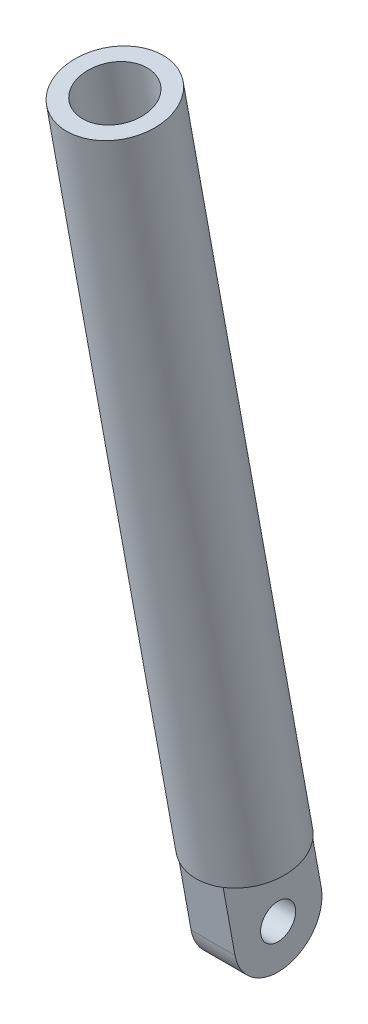
ISO-10303-21;
HEADER;
FILE_DESCRIPTION(('STEP AP214'),'2;1');
FILE_NAME('part.step','',(''),(''),'','','');
FILE_SCHEMA(('AUTOMOTIVE_DESIGN { 1 0 10303 214 1 1 1 1 }'));
ENDSEC;
DATA;
#1=APPLICATION_CONTEXT('core data for automotive mechanical design processes');
#2=APPLICATION_PROTOCOL_DEFINITION('international standard','automotive_design',2000,#1);
#3=PRODUCT_CONTEXT('',#1,'mechanical');
#4=PRODUCT('Part','Part','',(#3));
#5=PRODUCT_RELATED_PRODUCT_CATEGORY('part','',(#4));
#6=PRODUCT_DEFINITION_FORMATION('','',#4);
#7=PRODUCT_DEFINITION_CONTEXT('part definition',#1,'design');
#8=PRODUCT_DEFINITION('design','',#6,#7);
#9=PRODUCT_DEFINITION_SHAPE('','',#8);
#10=(LENGTH_UNIT() NAMED_UNIT(*) SI_UNIT(.MILLI.,.METRE.));
#11=(NAMED_UNIT(*) PLANE_ANGLE_UNIT() SI_UNIT($,.RADIAN.));
#12=(NAMED_UNIT(*) SI_UNIT($,.STERADIAN.) SOLID_ANGLE_UNIT());
#13=UNCERTAINTY_MEASURE_WITH_UNIT(LENGTH_MEASURE(1.E-05),#10,'distance_accuracy_value','');
#14=(GEOMETRIC_REPRESENTATION_CONTEXT(3) GLOBAL_UNCERTAINTY_ASSIGNED_CONTEXT((#13)) GLOBAL_UNIT_ASSIGNED_CONTEXT((#10,
#11,#12)) REPRESENTATION_CONTEXT('',''));
#15=CARTESIAN_POINT('',(0.,0.,0.));
#16=DIRECTION('',(0.,0.,1.));
#17=DIRECTION('',(1.,0.,0.));
#18=AXIS2_PLACEMENT_3D('',#15,#16,#17);
#19=CARTESIAN_POINT('',(1550.00000000001,-478.633122855309,65.2704072888008));
#20=DIRECTION('',(0.,-0.983852787309741,-0.178979587950284));
#21=DIRECTION('',(-1.,0.,0.));
#22=AXIS2_PLACEMENT_3D('',#19,#20,#21);
#23=PLANE('',#22);
#24=CARTESIAN_POINT('',(1550.00000000001,-478.633122855309,65.2704072888008));
#25=DIRECTION('',(0.,0.983852787309741,0.178979587950284));
#26=DIRECTION('',(1.,0.,0.));
#27=AXIS2_PLACEMENT_3D('',#24,#25,#26);
#28=CIRCLE('',#27,74.9999999999999);
#29=CARTESIAN_POINT('',(1625.00000000001,-478.633122855309,65.2704072888009));
#30=VERTEX_POINT('',#29);
#31=EDGE_CURVE('E19',#30,#30,#28,.T.);
#32=ORIENTED_EDGE('',*,*,#31,.T.);
#33=EDGE_LOOP('',(#32));
#34=FACE_BOUND('',#33,.T.);
#35=ADVANCED_FACE('F16',(#34),#23,.F.);
#36=CARTESIAN_POINT('',(1499.99999999996,-700.000000000001,24.9999999999866));
#37=DIRECTION('',(-1.,0.,0.));
#38=DIRECTION('',(0.,0.983852787309741,0.178979587950284));
#39=AXIS2_PLACEMENT_3D('',#36,#37,#38);
#40=CYLINDRICAL_SURFACE('',#39,40.);
#41=CARTESIAN_POINT('',(1499.99999999996,-700.000000000001,24.9999999999866));
#42=DIRECTION('',(-1.,0.,0.));
#43=DIRECTION('',(0.,0.983852787309741,0.178979587950284));
#44=AXIS2_PLACEMENT_3D('',#41,#42,#43);
#45=CIRCLE('',#44,40.);
#46=CARTESIAN_POINT('',(1499.99999999996,-660.645888507612,32.159183517998));
#47=VERTEX_POINT('',#46);
#48=EDGE_CURVE('E71',#47,#47,#45,.F.);
#49=ORIENTED_EDGE('',*,*,#48,.F.);
#50=EDGE_LOOP('',(#49));
#51=FACE_BOUND('',#50,.T.);
#52=CARTESIAN_POINT('',(1599.99999999996,-700.000000000001,24.9999999999866));
#53=DIRECTION('',(-1.,0.,0.));
#54=DIRECTION('',(0.,0.983852787309741,0.178979587950284));
#55=AXIS2_PLACEMENT_3D('',#52,#53,#54);
#56=CIRCLE('',#55,40.);
#57=CARTESIAN_POINT('',(1599.99999999996,-660.645888507612,32.159183517998));
#58=VERTEX_POINT('',#57);
#59=EDGE_CURVE('E65',#58,#58,#56,.T.);
#60=ORIENTED_EDGE('',*,*,#59,.F.);
#61=EDGE_LOOP('',(#60));
#62=FACE_BOUND('',#61,.T.);
#63=ADVANCED_FACE('F231',(#51,#62),#40,.F.);
#64=CARTESIAN_POINT('',(1599.99999999996,-700.000000000001,24.9999999999866));
#65=DIRECTION('',(-1.,0.,0.));
#66=DIRECTION('',(0.,0.983852787309741,0.178979587950284));
#67=AXIS2_PLACEMENT_3D('',#64,#65,#66);
#68=CYLINDRICAL_SURFACE('',#67,100.000000000001);
#69=CARTESIAN_POINT('',(1499.99999999996,-700.000000000001,24.9999999999866));
#70=DIRECTION('',(-1.,0.,0.));
#71=DIRECTION('',(0.,0.983852787309741,0.178979587950284));
#72=AXIS2_PLACEMENT_3D('',#69,#70,#71);
#73=CIRCLE('',#72,100.000000000001);
#74=CARTESIAN_POINT('',(1499.99999999996,-682.102041204972,-73.3852787309881));
#75=VERTEX_POINT('',#74);
#76=CARTESIAN_POINT('',(1499.99999999996,-717.897958795038,123.38527873096));
#77=VERTEX_POINT('',#76);
#78=EDGE_CURVE('E70',#75,#77,#73,.T.);
#79=ORIENTED_EDGE('',*,*,#78,.F.);
#80=DIRECTION('',(1.,0.,-2.3999686994746E-13));
#81=VECTOR('',#80,1.);
#82=CARTESIAN_POINT('',(1499.99999999996,-682.102041204972,-73.3852787309879));
#83=LINE('',#82,#81);
#84=CARTESIAN_POINT('',(1600.00000000001,-682.102041204968,-73.3852787310121));
#85=VERTEX_POINT('',#84);
#86=EDGE_CURVE('E67',#75,#85,#83,.T.);
#87=ORIENTED_EDGE('',*,*,#86,.T.);
#88=CARTESIAN_POINT('',(1600.00000000001,-700.000000000001,24.9999999999866));
#89=DIRECTION('',(-1.,0.,0.));
#90=DIRECTION('',(0.,0.983852787309741,0.178979587950284));
#91=AXIS2_PLACEMENT_3D('',#88,#89,#90);
#92=CIRCLE('',#91,100.000000000001);
#93=CARTESIAN_POINT('',(1599.99999999998,-717.897958795042,123.385278730984));
#94=VERTEX_POINT('',#93);
#95=EDGE_CURVE('E54',#94,#85,#92,.F.);
#96=ORIENTED_EDGE('',*,*,#95,.F.);
#97=DIRECTION('',(-1.,0.,-2.4061337766998E-13));
#98=VECTOR('',#97,1.);
#99=CARTESIAN_POINT('',(1600.00000000001,-717.897958795049,123.385278730983));
#100=LINE('',#99,#98);
#101=EDGE_CURVE('E83',#94,#77,#100,.T.);
#102=ORIENTED_EDGE('',*,*,#101,.T.);
#103=EDGE_LOOP('',(#79,#87,#96,#102));
#104=FACE_BOUND('',#103,.T.);
#105=ADVANCED_FACE('F68',(#104),#68,.T.);
#106=CARTESIAN_POINT('',(1600.00000000001,-570.320040698588,150.232216923525));
#107=DIRECTION('',(2.44550698842452E-13,0.178979587950284,-0.983852787309741));
#108=DIRECTION('',(-1.,0.,-2.4061337766998E-13));
#109=AXIS2_PLACEMENT_3D('',#106,#107,#108);
#110=PLANE('',#109);
#111=DIRECTION('',(0.,-0.983852787309741,-0.178979587950284));
#112=VECTOR('',#111,1.);
#113=CARTESIAN_POINT('',(1599.99999999996,-717.897958795033,123.385278730985));
#114=LINE('',#113,#112);
#115=CARTESIAN_POINT('',(1599.99999999998,-570.320040698581,150.232216923527));
#116=VERTEX_POINT('',#115);
#117=EDGE_CURVE('E64',#116,#94,#114,.T.);
#118=ORIENTED_EDGE('',*,*,#117,.F.);
#119=DIRECTION('',(1.,0.,0.));
#120=VECTOR('',#119,1.);
#121=CARTESIAN_POINT('',(1550.00000000001,-570.320040698573,150.232216923528));
#122=LINE('',#121,#120);
#123=CARTESIAN_POINT('',(1499.99999999998,-570.320040698571,150.232216923516));
#124=VERTEX_POINT('',#123);
#125=EDGE_CURVE('E101',#116,#124,#122,.F.);
#126=ORIENTED_EDGE('',*,*,#125,.T.);
#127=DIRECTION('',(0.,0.983852787309741,0.178979587950284));
#128=VECTOR('',#127,1.);
#129=CARTESIAN_POINT('',(1499.99999999996,-717.89795879503,123.385278730961));
#130=LINE('',#129,#128);
#131=EDGE_CURVE('E80',#77,#124,#130,.T.);
#132=ORIENTED_EDGE('',*,*,#131,.F.);
#133=ORIENTED_EDGE('',*,*,#101,.F.);
#134=EDGE_LOOP('',(#118,#126,#132,#133));
#135=FACE_BOUND('',#134,.T.);
#136=ADVANCED_FACE('F112',(#135),#110,.F.);
#137=CARTESIAN_POINT('',(1550.00000000001,1070.93501715753,347.163258310499));
#138=DIRECTION('',(0.,0.983852787309741,0.178979587950284));
#139=DIRECTION('',(1.,0.,0.));
#140=AXIS2_PLACEMENT_3D('',#137,#138,#139);
#141=CYLINDRICAL_SURFACE('',#140,74.9999999999999);
#142=CARTESIAN_POINT('',(1550.00000000001,1070.93501715753,347.163258310499));
#143=DIRECTION('',(0.,0.983852787309741,0.178979587950284));
#144=DIRECTION('',(1.,0.,0.));
#145=AXIS2_PLACEMENT_3D('',#142,#143,#144);
#146=CIRCLE('',#145,74.9999999999999);
#147=CARTESIAN_POINT('',(1625.00000000001,1070.93501715753,347.163258310499));
#148=VERTEX_POINT('',#147);
#149=EDGE_CURVE('E97',#148,#148,#146,.F.);
#150=ORIENTED_EDGE('',*,*,#149,.F.);
#151=EDGE_LOOP('',(#150));
#152=FACE_BOUND('',#151,.T.);
#153=ORIENTED_EDGE('',*,*,#31,.F.);
#154=EDGE_LOOP('',(#153));
#155=FACE_BOUND('',#154,.T.);
#156=ADVANCED_FACE('F110',(#152,#155),#141,.F.);
#157=CARTESIAN_POINT('',(1599.99999999996,-682.102041204972,-73.3852787309879));
#158=DIRECTION('',(1.,0.,0.));
#159=DIRECTION('',(0.,-0.983852787309741,-0.178979587950284));
#160=AXIS2_PLACEMENT_3D('',#157,#158,#159);
#161=PLANE('',#160);
#162=DIRECTION('',(0.,0.178979587950284,-0.983852787309741));
#163=VECTOR('',#162,1.);
#164=CARTESIAN_POINT('',(1600.00000000001,-552.42208190354,51.8469381925293));
#165=LINE('',#164,#163);
#166=CARTESIAN_POINT('',(1600.00000000003,-534.524123108517,-46.5383405384587));
#167=VERTEX_POINT('',#166);
#168=EDGE_CURVE('E100',#167,#116,#165,.F.);
#169=ORIENTED_EDGE('',*,*,#168,.T.);
#170=ORIENTED_EDGE('',*,*,#117,.T.);
#171=ORIENTED_EDGE('',*,*,#95,.T.);
#172=DIRECTION('',(0.,0.983852787309741,0.178979587950284));
#173=VECTOR('',#172,1.);
#174=CARTESIAN_POINT('',(1600.00000000001,-534.524123108523,-46.5383405384721));
#175=LINE('',#174,#173);
#176=EDGE_CURVE('E62',#85,#167,#175,.T.);
#177=ORIENTED_EDGE('',*,*,#176,.T.);
#178=EDGE_LOOP('',(#169,#170,#171,#177));
#179=FACE_BOUND('',#178,.T.);
#180=ORIENTED_EDGE('',*,*,#59,.T.);
#181=EDGE_LOOP('',(#180));
#182=FACE_BOUND('',#181,.T.);
#183=ADVANCED_FACE('F59',(#179,#182),#161,.T.);
#184=CARTESIAN_POINT('',(1499.99999999996,-534.524123108527,-46.5383405384481));
#185=DIRECTION('',(2.43947431992373E-13,-0.178979587950284,0.983852787309741));
#186=DIRECTION('',(1.,0.,-2.3999686994746E-13));
#187=AXIS2_PLACEMENT_3D('',#184,#185,#186);
#188=PLANE('',#187);
#189=DIRECTION('',(0.,0.983852787309741,0.178979587950284));
#190=VECTOR('',#189,1.);
#191=CARTESIAN_POINT('',(1499.99999999996,-682.102041204973,-73.3852787309881));
#192=LINE('',#191,#190);
#193=CARTESIAN_POINT('',(1499.99999999996,-534.524123108519,-46.5383405384467));
#194=VERTEX_POINT('',#193);
#195=EDGE_CURVE('E34',#194,#75,#192,.F.);
#196=ORIENTED_EDGE('',*,*,#195,.F.);
#197=DIRECTION('',(1.,0.,0.));
#198=VECTOR('',#197,1.);
#199=CARTESIAN_POINT('',(1550.00000000001,-534.524123108512,-46.5383405384454));
#200=LINE('',#199,#198);
#201=EDGE_CURVE('E75',#194,#167,#200,.T.);
#202=ORIENTED_EDGE('',*,*,#201,.T.);
#203=ORIENTED_EDGE('',*,*,#176,.F.);
#204=ORIENTED_EDGE('',*,*,#86,.F.);
#205=EDGE_LOOP('',(#196,#202,#203,#204));
#206=FACE_BOUND('',#205,.T.);
#207=ADVANCED_FACE('F73',(#206),#188,.F.);
#208=CARTESIAN_POINT('',(1499.99999999996,-700.000000000001,24.9999999999861));
#209=DIRECTION('',(-1.,0.,0.));
#210=DIRECTION('',(0.,0.983852787309741,0.178979587950284));
#211=AXIS2_PLACEMENT_3D('',#208,#209,#210);
#212=PLANE('',#211);
#213=DIRECTION('',(0.,0.178979587950284,-0.983852787309741));
#214=VECTOR('',#213,1.);
#215=CARTESIAN_POINT('',(1499.99999999996,-552.42208190354,51.8469381925293));
#216=LINE('',#215,#214);
#217=EDGE_CURVE('E96',#124,#194,#216,.T.);
#218=ORIENTED_EDGE('',*,*,#217,.T.);
#219=ORIENTED_EDGE('',*,*,#195,.T.);
#220=ORIENTED_EDGE('',*,*,#78,.T.);
#221=ORIENTED_EDGE('',*,*,#131,.T.);
#222=EDGE_LOOP('',(#218,#219,#220,#221));
#223=FACE_BOUND('',#222,.T.);
#224=ORIENTED_EDGE('',*,*,#48,.T.);
#225=EDGE_LOOP('',(#224));
#226=FACE_BOUND('',#225,.T.);
#227=ADVANCED_FACE('F151',(#223,#226),#212,.T.);
#228=CARTESIAN_POINT('',(1550.00000000001,-552.42208190354,51.8469381925293));
#229=DIRECTION('',(0.,0.983852787309741,0.178979587950284));
#230=DIRECTION('',(1.,0.,0.));
#231=AXIS2_PLACEMENT_3D('',#228,#229,#230);
#232=PLANE('',#231);
#233=ORIENTED_EDGE('',*,*,#125,.F.);
#234=CARTESIAN_POINT('',(1550.00000000001,-552.42208190354,51.8469381925293));
#235=DIRECTION('',(0.,-0.983852787309741,-0.178979587950284));
#236=DIRECTION('',(-1.,0.,0.));
#237=AXIS2_PLACEMENT_3D('',#234,#235,#236);
#238=CIRCLE('',#237,111.803398875012);
#239=EDGE_CURVE('E93',#124,#116,#238,.F.);
#240=ORIENTED_EDGE('',*,*,#239,.F.);
#241=EDGE_LOOP('',(#233,#240));
#242=FACE_BOUND('',#241,.T.);
#243=ADVANCED_FACE('F147',(#242),#232,.F.);
#244=CARTESIAN_POINT('',(1550.00000000001,1070.93501715753,347.163258310499));
#245=DIRECTION('',(0.,0.983852787309741,0.178979587950284));
#246=DIRECTION('',(1.,0.,0.));
#247=AXIS2_PLACEMENT_3D('',#244,#245,#246);
#248=PLANE('',#247);
#249=CARTESIAN_POINT('',(1550.00000000001,1070.93501715753,347.163258310499));
#250=DIRECTION('',(0.,-0.983852787309741,-0.178979587950284));
#251=DIRECTION('',(-1.,0.,0.));
#252=AXIS2_PLACEMENT_3D('',#249,#250,#251);
#253=CIRCLE('',#252,111.803398875012);
#254=CARTESIAN_POINT('',(1438.196601125,1070.93501715753,347.163258310499));
#255=VERTEX_POINT('',#254);
#256=EDGE_CURVE('E90',#255,#255,#253,.T.);
#257=ORIENTED_EDGE('',*,*,#256,.F.);
#258=EDGE_LOOP('',(#257));
#259=FACE_BOUND('',#258,.T.);
#260=ORIENTED_EDGE('',*,*,#149,.T.);
#261=EDGE_LOOP('',(#260));
#262=FACE_BOUND('',#261,.T.);
#263=ADVANCED_FACE('F143',(#259,#262),#248,.T.);
#264=CARTESIAN_POINT('',(1550.00000000001,-552.42208190354,51.8469381925293));
#265=DIRECTION('',(0.,0.983852787309741,0.178979587950284));
#266=DIRECTION('',(1.,0.,0.));
#267=AXIS2_PLACEMENT_3D('',#264,#265,#266);
#268=PLANE('',#267);
#269=CARTESIAN_POINT('',(1550.00000000001,-552.42208190354,51.8469381925293));
#270=DIRECTION('',(0.,-0.983852787309741,-0.178979587950284));
#271=DIRECTION('',(-1.,0.,0.));
#272=AXIS2_PLACEMENT_3D('',#269,#270,#271);
#273=CIRCLE('',#272,111.803398875012);
#274=EDGE_CURVE('E87',#116,#167,#273,.F.);
#275=ORIENTED_EDGE('',*,*,#274,.F.);
#276=ORIENTED_EDGE('',*,*,#168,.F.);
#277=EDGE_LOOP('',(#275,#276));
#278=FACE_BOUND('',#277,.T.);
#279=ADVANCED_FACE('F139',(#278),#268,.F.);
#280=CARTESIAN_POINT('',(1550.00000000001,-552.42208190354,51.8469381925293));
#281=DIRECTION('',(0.,0.983852787309741,0.178979587950284));
#282=DIRECTION('',(1.,0.,0.));
#283=AXIS2_PLACEMENT_3D('',#280,#281,#282);
#284=PLANE('',#283);
#285=ORIENTED_EDGE('',*,*,#201,.F.);
#286=CARTESIAN_POINT('',(1550.00000000001,-552.422081903555,51.8469381925266));
#287=DIRECTION('',(0.,-0.983852787309741,-0.178979587950284));
#288=DIRECTION('',(-1.,0.,0.));
#289=AXIS2_PLACEMENT_3D('',#286,#287,#288);
#290=CIRCLE('',#289,111.803398875012);
#291=EDGE_CURVE('E25',#167,#194,#290,.F.);
#292=ORIENTED_EDGE('',*,*,#291,.F.);
#293=EDGE_LOOP('',(#285,#292));
#294=FACE_BOUND('',#293,.T.);
#295=ADVANCED_FACE('F132',(#294),#284,.F.);
#296=CARTESIAN_POINT('',(1550.00000000001,-552.42208190354,51.8469381925293));
#297=DIRECTION('',(0.,0.983852787309741,0.178979587950284));
#298=DIRECTION('',(1.,0.,0.));
#299=AXIS2_PLACEMENT_3D('',#296,#297,#298);
#300=PLANE('',#299);
#301=CARTESIAN_POINT('',(1550.00000000001,-552.422081903555,51.8469381925266));
#302=DIRECTION('',(0.,-0.983852787309741,-0.178979587950284));
#303=DIRECTION('',(-1.,0.,0.));
#304=AXIS2_PLACEMENT_3D('',#301,#302,#303);
#305=CIRCLE('',#304,111.803398875012);
#306=EDGE_CURVE('E10',#194,#124,#305,.F.);
#307=ORIENTED_EDGE('',*,*,#306,.F.);
#308=ORIENTED_EDGE('',*,*,#217,.F.);
#309=EDGE_LOOP('',(#307,#308));
#310=FACE_BOUND('',#309,.T.);
#311=ADVANCED_FACE('F126',(#310),#300,.F.);
#312=CARTESIAN_POINT('',(1550.00000000001,1070.93501715753,347.163258310499));
#313=DIRECTION('',(0.,-0.983852787309741,-0.178979587950284));
#314=DIRECTION('',(-1.,0.,0.));
#315=AXIS2_PLACEMENT_3D('',#312,#313,#314);
#316=CYLINDRICAL_SURFACE('',#315,111.803398875012);
#317=ORIENTED_EDGE('',*,*,#239,.T.);
#318=ORIENTED_EDGE('',*,*,#274,.T.);
#319=ORIENTED_EDGE('',*,*,#291,.T.);
#320=ORIENTED_EDGE('',*,*,#306,.T.);
#321=EDGE_LOOP('',(#317,#318,#319,#320));
#322=FACE_BOUND('',#321,.T.);
#323=ORIENTED_EDGE('',*,*,#256,.T.);
#324=EDGE_LOOP('',(#323));
#325=FACE_BOUND('',#324,.T.);
#326=ADVANCED_FACE('F124',(#322,#325),#316,.T.);
#327=CLOSED_SHELL('',(#35,#63,#105,#136,#156,#183,#207,#227,#243,#263,#279,#295,#311,#326));
#328=MANIFOLD_SOLID_BREP('B1',#327);
#329=ADVANCED_BREP_SHAPE_REPRESENTATION('',(#18,#328),#14);
#330=SHAPE_DEFINITION_REPRESENTATION(#9,#329);
ENDSEC;
END-ISO-10303-21;
